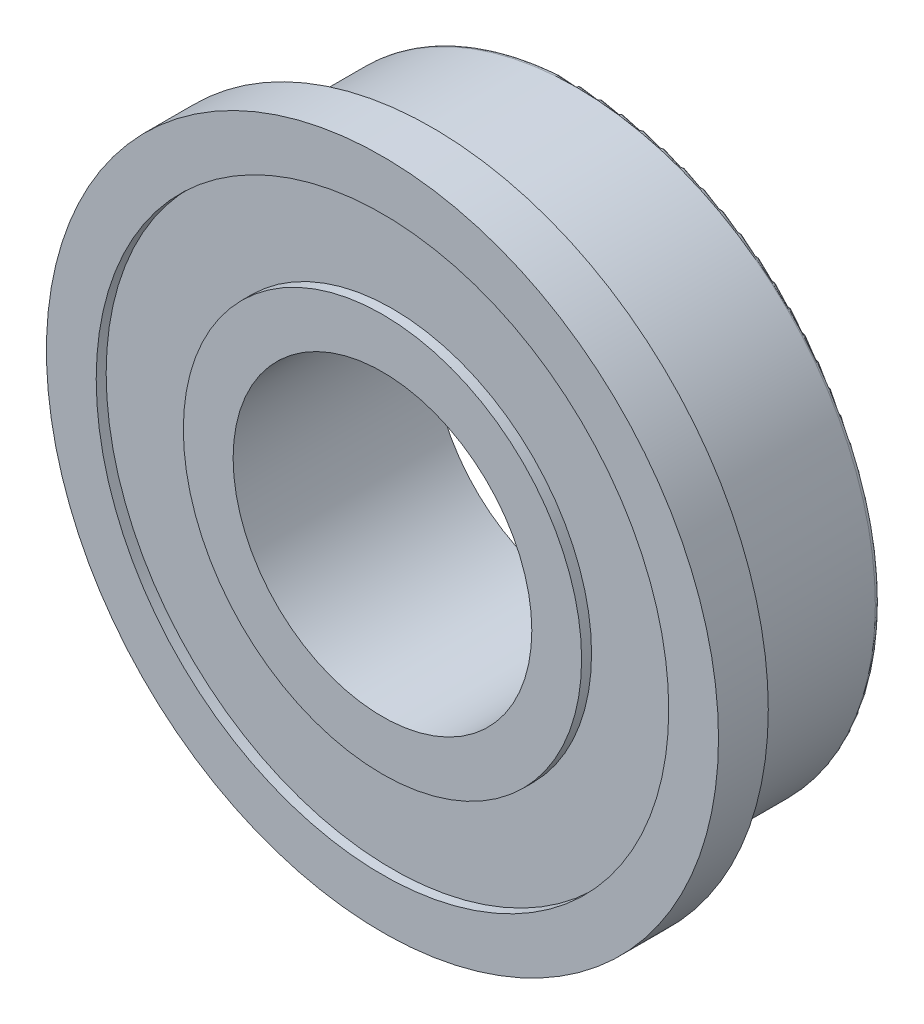
ISO-10303-21;
HEADER;
FILE_DESCRIPTION(('STEP AP214'),'2;1');
FILE_NAME('part.step','',(''),(''),'','','');
FILE_SCHEMA(('AUTOMOTIVE_DESIGN { 1 0 10303 214 1 1 1 1 }'));
ENDSEC;
DATA;
#1=APPLICATION_CONTEXT('core data for automotive mechanical design processes');
#2=APPLICATION_PROTOCOL_DEFINITION('international standard','automotive_design',2000,#1);
#3=PRODUCT_CONTEXT('',#1,'mechanical');
#4=PRODUCT('Part','Part','',(#3));
#5=PRODUCT_RELATED_PRODUCT_CATEGORY('part','',(#4));
#6=PRODUCT_DEFINITION_FORMATION('','',#4);
#7=PRODUCT_DEFINITION_CONTEXT('part definition',#1,'design');
#8=PRODUCT_DEFINITION('design','',#6,#7);
#9=PRODUCT_DEFINITION_SHAPE('','',#8);
#10=(LENGTH_UNIT() NAMED_UNIT(*) SI_UNIT(.MILLI.,.METRE.));
#11=(NAMED_UNIT(*) PLANE_ANGLE_UNIT() SI_UNIT($,.RADIAN.));
#12=(NAMED_UNIT(*) SI_UNIT($,.STERADIAN.) SOLID_ANGLE_UNIT());
#13=UNCERTAINTY_MEASURE_WITH_UNIT(LENGTH_MEASURE(1.E-05),#10,'distance_accuracy_value','');
#14=(GEOMETRIC_REPRESENTATION_CONTEXT(3) GLOBAL_UNCERTAINTY_ASSIGNED_CONTEXT((#13)) GLOBAL_UNIT_ASSIGNED_CONTEXT((#10,
#11,#12)) REPRESENTATION_CONTEXT('',''));
#15=CARTESIAN_POINT('',(0.,0.,0.));
#16=DIRECTION('',(0.,0.,1.));
#17=DIRECTION('',(1.,0.,0.));
#18=AXIS2_PLACEMENT_3D('',#15,#16,#17);
#19=CARTESIAN_POINT('',(0.,0.,4.));
#20=DIRECTION('',(0.,0.,1.));
#21=DIRECTION('',(1.,0.,0.));
#22=AXIS2_PLACEMENT_3D('',#19,#20,#21);
#23=PLANE('',#22);
#24=CARTESIAN_POINT('',(0.,0.,4.));
#25=DIRECTION('',(0.,0.,-1.));
#26=DIRECTION('',(-1.,0.,0.));
#27=AXIS2_PLACEMENT_3D('',#24,#25,#26);
#28=CIRCLE('',#27,3.);
#29=CARTESIAN_POINT('',(-3.,0.,4.));
#30=VERTEX_POINT('',#29);
#31=EDGE_CURVE('E53',#30,#30,#28,.T.);
#32=ORIENTED_EDGE('',*,*,#31,.T.);
#33=EDGE_LOOP('',(#32));
#34=FACE_BOUND('',#33,.T.);
#35=CARTESIAN_POINT('',(0.,0.,4.));
#36=DIRECTION('',(0.,0.,1.));
#37=DIRECTION('',(1.,0.,0.));
#38=AXIS2_PLACEMENT_3D('',#35,#36,#37);
#39=CIRCLE('',#38,4.);
#40=CARTESIAN_POINT('',(4.,0.,4.));
#41=VERTEX_POINT('',#40);
#42=EDGE_CURVE('E80',#41,#41,#39,.T.);
#43=ORIENTED_EDGE('',*,*,#42,.T.);
#44=EDGE_LOOP('',(#43));
#45=FACE_BOUND('',#44,.T.);
#46=ADVANCED_FACE('F32',(#34,#45),#23,.T.);
#47=CARTESIAN_POINT('',(0.,0.,0.));
#48=DIRECTION('',(0.,0.,1.));
#49=DIRECTION('',(1.,0.,0.));
#50=AXIS2_PLACEMENT_3D('',#47,#48,#49);
#51=PLANE('',#50);
#52=CARTESIAN_POINT('',(0.,0.,0.));
#53=DIRECTION('',(0.,0.,-1.));
#54=DIRECTION('',(-1.,0.,0.));
#55=AXIS2_PLACEMENT_3D('',#52,#53,#54);
#56=CIRCLE('',#55,3.);
#57=CARTESIAN_POINT('',(-3.,0.,0.));
#58=VERTEX_POINT('',#57);
#59=EDGE_CURVE('E56',#58,#58,#56,.T.);
#60=ORIENTED_EDGE('',*,*,#59,.F.);
#61=EDGE_LOOP('',(#60));
#62=FACE_BOUND('',#61,.T.);
#63=CARTESIAN_POINT('',(0.,0.,0.));
#64=DIRECTION('',(0.,0.,-1.));
#65=DIRECTION('',(-1.,0.,0.));
#66=AXIS2_PLACEMENT_3D('',#63,#64,#65);
#67=CIRCLE('',#66,4.);
#68=CARTESIAN_POINT('',(-4.,0.,0.));
#69=VERTEX_POINT('',#68);
#70=EDGE_CURVE('E68',#69,#69,#67,.T.);
#71=ORIENTED_EDGE('',*,*,#70,.T.);
#72=EDGE_LOOP('',(#71));
#73=FACE_BOUND('',#72,.T.);
#74=ADVANCED_FACE('F123',(#62,#73),#51,.F.);
#75=CARTESIAN_POINT('',(0.,0.,4.));
#76=DIRECTION('',(0.,0.,-1.));
#77=DIRECTION('',(-1.,0.,0.));
#78=AXIS2_PLACEMENT_3D('',#75,#76,#77);
#79=CYLINDRICAL_SURFACE('',#78,6.);
#80=CARTESIAN_POINT('',(0.,0.,0.0999999999999998));
#81=DIRECTION('',(0.,0.,1.));
#82=DIRECTION('',(1.,0.,0.));
#83=AXIS2_PLACEMENT_3D('',#80,#81,#82);
#84=CIRCLE('',#83,6.);
#85=CARTESIAN_POINT('',(6.,0.,0.0999999999999998));
#86=VERTEX_POINT('',#85);
#87=EDGE_CURVE('E39',#86,#86,#84,.T.);
#88=ORIENTED_EDGE('',*,*,#87,.T.);
#89=EDGE_LOOP('',(#88));
#90=FACE_BOUND('',#89,.T.);
#91=CARTESIAN_POINT('',(0.,0.,3.));
#92=DIRECTION('',(0.,0.,1.));
#93=DIRECTION('',(1.,0.,0.));
#94=AXIS2_PLACEMENT_3D('',#91,#92,#93);
#95=CIRCLE('',#94,6.);
#96=CARTESIAN_POINT('',(6.,0.,3.));
#97=VERTEX_POINT('',#96);
#98=EDGE_CURVE('E43',#97,#97,#95,.T.);
#99=ORIENTED_EDGE('',*,*,#98,.F.);
#100=EDGE_LOOP('',(#99));
#101=FACE_BOUND('',#100,.T.);
#102=ADVANCED_FACE('F121',(#90,#101),#79,.T.);
#103=CARTESIAN_POINT('',(0.,0.,0.));
#104=DIRECTION('',(0.,0.,1.));
#105=DIRECTION('',(1.,0.,0.));
#106=AXIS2_PLACEMENT_3D('',#103,#104,#105);
#107=CIRCLE('',#106,5.9);
#108=CARTESIAN_POINT('',(5.9,0.,0.));
#109=VERTEX_POINT('',#108);
#110=EDGE_CURVE('E10',#109,#109,#107,.F.);
#111=ORIENTED_EDGE('',*,*,#110,.T.);
#112=EDGE_LOOP('',(#111));
#113=FACE_BOUND('',#112,.T.);
#114=CARTESIAN_POINT('',(0.,0.,0.));
#115=DIRECTION('',(0.,0.,-1.));
#116=DIRECTION('',(-1.,0.,0.));
#117=AXIS2_PLACEMENT_3D('',#114,#115,#116);
#118=CIRCLE('',#117,5.);
#119=CARTESIAN_POINT('',(-5.,0.,0.));
#120=VERTEX_POINT('',#119);
#121=EDGE_CURVE('E62',#120,#120,#118,.T.);
#122=ORIENTED_EDGE('',*,*,#121,.F.);
#123=EDGE_LOOP('',(#122));
#124=FACE_BOUND('',#123,.T.);
#125=ADVANCED_FACE('F112',(#113,#124),#51,.F.);
#126=CARTESIAN_POINT('',(0.,0.,3.));
#127=DIRECTION('',(0.,0.,1.));
#128=DIRECTION('',(1.,0.,0.));
#129=AXIS2_PLACEMENT_3D('',#126,#127,#128);
#130=CYLINDRICAL_SURFACE('',#129,6.75);
#131=CARTESIAN_POINT('',(0.,0.,3.));
#132=DIRECTION('',(0.,0.,1.));
#133=DIRECTION('',(1.,0.,0.));
#134=AXIS2_PLACEMENT_3D('',#131,#132,#133);
#135=CIRCLE('',#134,6.75);
#136=CARTESIAN_POINT('',(6.75,0.,3.));
#137=VERTEX_POINT('',#136);
#138=EDGE_CURVE('E47',#137,#137,#135,.T.);
#139=ORIENTED_EDGE('',*,*,#138,.T.);
#140=EDGE_LOOP('',(#139));
#141=FACE_BOUND('',#140,.T.);
#142=CARTESIAN_POINT('',(0.,0.,4.));
#143=DIRECTION('',(0.,0.,1.));
#144=DIRECTION('',(1.,0.,0.));
#145=AXIS2_PLACEMENT_3D('',#142,#143,#144);
#146=CIRCLE('',#145,6.75);
#147=CARTESIAN_POINT('',(6.75,0.,4.));
#148=VERTEX_POINT('',#147);
#149=EDGE_CURVE('E50',#148,#148,#146,.T.);
#150=ORIENTED_EDGE('',*,*,#149,.F.);
#151=EDGE_LOOP('',(#150));
#152=FACE_BOUND('',#151,.T.);
#153=ADVANCED_FACE('F110',(#141,#152),#130,.T.);
#154=CARTESIAN_POINT('',(0.,0.,3.));
#155=DIRECTION('',(0.,0.,1.));
#156=DIRECTION('',(1.,0.,0.));
#157=AXIS2_PLACEMENT_3D('',#154,#155,#156);
#158=PLANE('',#157);
#159=ORIENTED_EDGE('',*,*,#98,.T.);
#160=EDGE_LOOP('',(#159));
#161=FACE_BOUND('',#160,.T.);
#162=ORIENTED_EDGE('',*,*,#138,.F.);
#163=EDGE_LOOP('',(#162));
#164=FACE_BOUND('',#163,.T.);
#165=ADVANCED_FACE('F106',(#161,#164),#158,.F.);
#166=CARTESIAN_POINT('',(0.,0.,4.));
#167=DIRECTION('',(0.,0.,1.));
#168=DIRECTION('',(1.,0.,0.));
#169=AXIS2_PLACEMENT_3D('',#166,#167,#168);
#170=CIRCLE('',#169,5.75);
#171=CARTESIAN_POINT('',(5.75,0.,4.));
#172=VERTEX_POINT('',#171);
#173=EDGE_CURVE('E74',#172,#172,#170,.T.);
#174=ORIENTED_EDGE('',*,*,#173,.F.);
#175=EDGE_LOOP('',(#174));
#176=FACE_BOUND('',#175,.T.);
#177=ORIENTED_EDGE('',*,*,#149,.T.);
#178=EDGE_LOOP('',(#177));
#179=FACE_BOUND('',#178,.T.);
#180=ADVANCED_FACE('F102',(#176,#179),#23,.T.);
#181=CARTESIAN_POINT('',(0.,0.,4.));
#182=DIRECTION('',(0.,0.,-1.));
#183=DIRECTION('',(-1.,0.,0.));
#184=AXIS2_PLACEMENT_3D('',#181,#182,#183);
#185=CYLINDRICAL_SURFACE('',#184,3.);
#186=ORIENTED_EDGE('',*,*,#31,.F.);
#187=EDGE_LOOP('',(#186));
#188=FACE_BOUND('',#187,.T.);
#189=ORIENTED_EDGE('',*,*,#59,.T.);
#190=EDGE_LOOP('',(#189));
#191=FACE_BOUND('',#190,.T.);
#192=ADVANCED_FACE('F105',(#188,#191),#185,.F.);
#193=CARTESIAN_POINT('',(0.,0.,0.2));
#194=DIRECTION('',(0.,0.,-1.));
#195=DIRECTION('',(-1.,0.,0.));
#196=AXIS2_PLACEMENT_3D('',#193,#194,#195);
#197=CYLINDRICAL_SURFACE('',#196,5.);
#198=CARTESIAN_POINT('',(0.,0.,0.2));
#199=DIRECTION('',(0.,0.,-1.));
#200=DIRECTION('',(-1.,0.,0.));
#201=AXIS2_PLACEMENT_3D('',#198,#199,#200);
#202=CIRCLE('',#201,5.);
#203=CARTESIAN_POINT('',(-5.,0.,0.2));
#204=VERTEX_POINT('',#203);
#205=EDGE_CURVE('E59',#204,#204,#202,.T.);
#206=ORIENTED_EDGE('',*,*,#205,.F.);
#207=EDGE_LOOP('',(#206));
#208=FACE_BOUND('',#207,.T.);
#209=ORIENTED_EDGE('',*,*,#121,.T.);
#210=EDGE_LOOP('',(#209));
#211=FACE_BOUND('',#210,.T.);
#212=ADVANCED_FACE('F185',(#208,#211),#197,.F.);
#213=CARTESIAN_POINT('',(0.,0.,0.2));
#214=DIRECTION('',(0.,0.,-1.));
#215=DIRECTION('',(-1.,0.,0.));
#216=AXIS2_PLACEMENT_3D('',#213,#214,#215);
#217=PLANE('',#216);
#218=CARTESIAN_POINT('',(0.,0.,0.2));
#219=DIRECTION('',(0.,0.,-1.));
#220=DIRECTION('',(-1.,0.,0.));
#221=AXIS2_PLACEMENT_3D('',#218,#219,#220);
#222=CIRCLE('',#221,4.);
#223=CARTESIAN_POINT('',(-4.,0.,0.2));
#224=VERTEX_POINT('',#223);
#225=EDGE_CURVE('E65',#224,#224,#222,.T.);
#226=ORIENTED_EDGE('',*,*,#225,.F.);
#227=EDGE_LOOP('',(#226));
#228=FACE_BOUND('',#227,.T.);
#229=ORIENTED_EDGE('',*,*,#205,.T.);
#230=EDGE_LOOP('',(#229));
#231=FACE_BOUND('',#230,.T.);
#232=ADVANCED_FACE('F177',(#228,#231),#217,.T.);
#233=CARTESIAN_POINT('',(0.,0.,0.2));
#234=DIRECTION('',(0.,0.,-1.));
#235=DIRECTION('',(-1.,0.,0.));
#236=AXIS2_PLACEMENT_3D('',#233,#234,#235);
#237=CYLINDRICAL_SURFACE('',#236,4.);
#238=ORIENTED_EDGE('',*,*,#225,.T.);
#239=EDGE_LOOP('',(#238));
#240=FACE_BOUND('',#239,.T.);
#241=ORIENTED_EDGE('',*,*,#70,.F.);
#242=EDGE_LOOP('',(#241));
#243=FACE_BOUND('',#242,.T.);
#244=ADVANCED_FACE('F98',(#240,#243),#237,.T.);
#245=CARTESIAN_POINT('',(0.,0.,3.8));
#246=DIRECTION('',(0.,0.,1.));
#247=DIRECTION('',(1.,0.,0.));
#248=AXIS2_PLACEMENT_3D('',#245,#246,#247);
#249=CYLINDRICAL_SURFACE('',#248,5.75);
#250=CARTESIAN_POINT('',(0.,0.,3.8));
#251=DIRECTION('',(0.,0.,1.));
#252=DIRECTION('',(1.,0.,0.));
#253=AXIS2_PLACEMENT_3D('',#250,#251,#252);
#254=CIRCLE('',#253,5.75);
#255=CARTESIAN_POINT('',(5.75,0.,3.8));
#256=VERTEX_POINT('',#255);
#257=EDGE_CURVE('E71',#256,#256,#254,.T.);
#258=ORIENTED_EDGE('',*,*,#257,.F.);
#259=EDGE_LOOP('',(#258));
#260=FACE_BOUND('',#259,.T.);
#261=ORIENTED_EDGE('',*,*,#173,.T.);
#262=EDGE_LOOP('',(#261));
#263=FACE_BOUND('',#262,.T.);
#264=ADVANCED_FACE('F92',(#260,#263),#249,.F.);
#265=CARTESIAN_POINT('',(0.,0.,3.8));
#266=DIRECTION('',(0.,0.,1.));
#267=DIRECTION('',(1.,0.,0.));
#268=AXIS2_PLACEMENT_3D('',#265,#266,#267);
#269=PLANE('',#268);
#270=CARTESIAN_POINT('',(0.,0.,3.8));
#271=DIRECTION('',(0.,0.,1.));
#272=DIRECTION('',(1.,0.,0.));
#273=AXIS2_PLACEMENT_3D('',#270,#271,#272);
#274=CIRCLE('',#273,4.);
#275=CARTESIAN_POINT('',(4.,0.,3.8));
#276=VERTEX_POINT('',#275);
#277=EDGE_CURVE('E77',#276,#276,#274,.T.);
#278=ORIENTED_EDGE('',*,*,#277,.F.);
#279=EDGE_LOOP('',(#278));
#280=FACE_BOUND('',#279,.T.);
#281=ORIENTED_EDGE('',*,*,#257,.T.);
#282=EDGE_LOOP('',(#281));
#283=FACE_BOUND('',#282,.T.);
#284=ADVANCED_FACE('F89',(#280,#283),#269,.T.);
#285=CARTESIAN_POINT('',(0.,0.,3.8));
#286=DIRECTION('',(0.,0.,1.));
#287=DIRECTION('',(1.,0.,0.));
#288=AXIS2_PLACEMENT_3D('',#285,#286,#287);
#289=CYLINDRICAL_SURFACE('',#288,4.);
#290=ORIENTED_EDGE('',*,*,#277,.T.);
#291=EDGE_LOOP('',(#290));
#292=FACE_BOUND('',#291,.T.);
#293=ORIENTED_EDGE('',*,*,#42,.F.);
#294=EDGE_LOOP('',(#293));
#295=FACE_BOUND('',#294,.T.);
#296=ADVANCED_FACE('F86',(#292,#295),#289,.T.);
#297=CARTESIAN_POINT('',(0.,0.,0.0999999999999998));
#298=DIRECTION('',(0.,0.,1.));
#299=DIRECTION('',(1.,0.,0.));
#300=AXIS2_PLACEMENT_3D('',#297,#298,#299);
#301=TOROIDAL_SURFACE('',#300,5.9,0.1);
#302=ORIENTED_EDGE('',*,*,#110,.F.);
#303=EDGE_LOOP('',(#302));
#304=FACE_BOUND('',#303,.T.);
#305=ORIENTED_EDGE('',*,*,#87,.F.);
#306=EDGE_LOOP('',(#305));
#307=FACE_BOUND('',#306,.T.);
#308=ADVANCED_FACE('F34',(#304,#307),#301,.T.);
#309=CLOSED_SHELL('',(#46,#74,#102,#125,#153,#165,#180,#192,#212,#232,#244,#264,#284,#296,#308));
#310=MANIFOLD_SOLID_BREP('B2',#309);
#311=ADVANCED_BREP_SHAPE_REPRESENTATION('',(#18,#310),#14);
#312=SHAPE_DEFINITION_REPRESENTATION(#9,#311);
ENDSEC;
END-ISO-10303-21;
